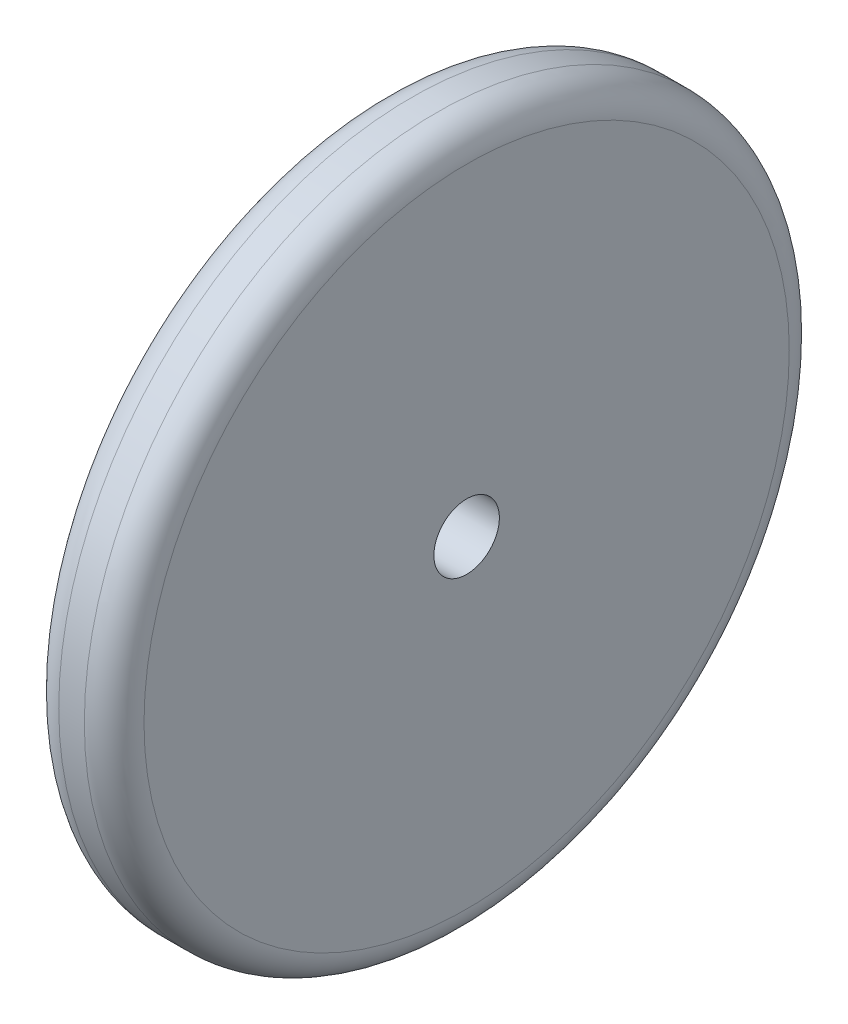
ISO-10303-21;
HEADER;
FILE_DESCRIPTION(('STEP AP214'),'2;1');
FILE_NAME('part.step','',(''),(''),'','','');
FILE_SCHEMA(('AUTOMOTIVE_DESIGN { 1 0 10303 214 1 1 1 1 }'));
ENDSEC;
DATA;
#1=APPLICATION_CONTEXT('core data for automotive mechanical design processes');
#2=APPLICATION_PROTOCOL_DEFINITION('international standard','automotive_design',2000,#1);
#3=PRODUCT_CONTEXT('',#1,'mechanical');
#4=PRODUCT('Part','Part','',(#3));
#5=PRODUCT_RELATED_PRODUCT_CATEGORY('part','',(#4));
#6=PRODUCT_DEFINITION_FORMATION('','',#4);
#7=PRODUCT_DEFINITION_CONTEXT('part definition',#1,'design');
#8=PRODUCT_DEFINITION('design','',#6,#7);
#9=PRODUCT_DEFINITION_SHAPE('','',#8);
#10=(LENGTH_UNIT() NAMED_UNIT(*) SI_UNIT(.MILLI.,.METRE.));
#11=(NAMED_UNIT(*) PLANE_ANGLE_UNIT() SI_UNIT($,.RADIAN.));
#12=(NAMED_UNIT(*) SI_UNIT($,.STERADIAN.) SOLID_ANGLE_UNIT());
#13=UNCERTAINTY_MEASURE_WITH_UNIT(LENGTH_MEASURE(1.E-05),#10,'distance_accuracy_value','');
#14=(GEOMETRIC_REPRESENTATION_CONTEXT(3) GLOBAL_UNCERTAINTY_ASSIGNED_CONTEXT((#13)) GLOBAL_UNIT_ASSIGNED_CONTEXT((#10,
#11,#12)) REPRESENTATION_CONTEXT('',''));
#15=CARTESIAN_POINT('',(0.,0.,0.));
#16=DIRECTION('',(0.,0.,1.));
#17=DIRECTION('',(1.,0.,0.));
#18=AXIS2_PLACEMENT_3D('',#15,#16,#17);
#19=CARTESIAN_POINT('',(-88.154662924112,-99.4140414395688,18.1527790152953));
#20=DIRECTION('',(-1.,0.,0.));
#21=DIRECTION('',(0.,0.,1.));
#22=AXIS2_PLACEMENT_3D('',#19,#20,#21);
#23=CYLINDRICAL_SURFACE('',#22,1.94999999999999);
#24=CARTESIAN_POINT('',(-78.634049076141,-99.4140414395688,18.1527790152953));
#25=DIRECTION('',(-1.,0.,0.));
#26=DIRECTION('',(0.,0.,1.));
#27=AXIS2_PLACEMENT_3D('',#24,#25,#26);
#28=CIRCLE('',#27,1.94999999999999);
#29=CARTESIAN_POINT('',(-78.634049076141,-99.4140414395688,20.1027790152953));
#30=VERTEX_POINT('',#29);
#31=EDGE_CURVE('E52',#30,#30,#28,.T.);
#32=ORIENTED_EDGE('',*,*,#31,.T.);
#33=EDGE_LOOP('',(#32));
#34=FACE_BOUND('',#33,.T.);
#35=CARTESIAN_POINT('',(-73.554049076141,-99.4140414395688,18.1527790152953));
#36=DIRECTION('',(-1.,0.,0.));
#37=DIRECTION('',(0.,0.,1.));
#38=AXIS2_PLACEMENT_3D('',#35,#36,#37);
#39=CIRCLE('',#38,1.94999999999999);
#40=CARTESIAN_POINT('',(-73.554049076141,-99.4140414395688,20.1027790152953));
#41=VERTEX_POINT('',#40);
#42=EDGE_CURVE('E55',#41,#41,#39,.T.);
#43=ORIENTED_EDGE('',*,*,#42,.F.);
#44=EDGE_LOOP('',(#43));
#45=FACE_BOUND('',#44,.T.);
#46=ADVANCED_FACE('F32',(#34,#45),#23,.F.);
#47=CARTESIAN_POINT('',(-78.634049076141,-97.4640414395688,18.1527790152953));
#48=DIRECTION('',(-1.,0.,0.));
#49=DIRECTION('',(0.,0.,1.));
#50=AXIS2_PLACEMENT_3D('',#47,#48,#49);
#51=PLANE('',#50);
#52=CARTESIAN_POINT('',(-78.634049076141,-99.4140414395688,18.1527790152953));
#53=DIRECTION('',(-1.,0.,0.));
#54=DIRECTION('',(0.,0.,1.));
#55=AXIS2_PLACEMENT_3D('',#52,#53,#54);
#56=CIRCLE('',#55,19.222);
#57=CARTESIAN_POINT('',(-78.634049076141,-99.4140414395688,37.3747790152953));
#58=VERTEX_POINT('',#57);
#59=EDGE_CURVE('E47',#58,#58,#56,.T.);
#60=ORIENTED_EDGE('',*,*,#59,.T.);
#61=EDGE_LOOP('',(#60));
#62=FACE_BOUND('',#61,.T.);
#63=ORIENTED_EDGE('',*,*,#31,.F.);
#64=EDGE_LOOP('',(#63));
#65=FACE_BOUND('',#64,.T.);
#66=ADVANCED_FACE('F62',(#62,#65),#51,.T.);
#67=CARTESIAN_POINT('',(-88.154662924112,-99.4140414395688,18.1527790152953));
#68=DIRECTION('',(-1.,0.,0.));
#69=DIRECTION('',(0.,0.,1.));
#70=AXIS2_PLACEMENT_3D('',#67,#68,#69);
#71=CYLINDRICAL_SURFACE('',#70,21.);
#72=CARTESIAN_POINT('',(-76.856049076141,-99.4140414395688,18.1527790152953));
#73=DIRECTION('',(-1.,0.,0.));
#74=DIRECTION('',(0.,0.,1.));
#75=AXIS2_PLACEMENT_3D('',#72,#73,#74);
#76=CIRCLE('',#75,21.);
#77=CARTESIAN_POINT('',(-76.856049076141,-99.4140414395688,39.1527790152953));
#78=VERTEX_POINT('',#77);
#79=EDGE_CURVE('E39',#78,#78,#76,.F.);
#80=ORIENTED_EDGE('',*,*,#79,.T.);
#81=EDGE_LOOP('',(#80));
#82=FACE_BOUND('',#81,.T.);
#83=CARTESIAN_POINT('',(-75.332049076141,-99.4140414395688,18.1527790152953));
#84=DIRECTION('',(1.,0.,0.));
#85=DIRECTION('',(0.,0.,-1.));
#86=AXIS2_PLACEMENT_3D('',#83,#84,#85);
#87=CIRCLE('',#86,21.);
#88=CARTESIAN_POINT('',(-75.332049076141,-99.4140414395688,-2.84722098470466));
#89=VERTEX_POINT('',#88);
#90=EDGE_CURVE('E43',#89,#89,#87,.F.);
#91=ORIENTED_EDGE('',*,*,#90,.T.);
#92=EDGE_LOOP('',(#91));
#93=FACE_BOUND('',#92,.T.);
#94=ADVANCED_FACE('F68',(#82,#93),#71,.T.);
#95=CARTESIAN_POINT('',(-73.554049076141,-97.4640414395688,18.1527790152953));
#96=DIRECTION('',(1.,0.,0.));
#97=DIRECTION('',(0.,0.,-1.));
#98=AXIS2_PLACEMENT_3D('',#95,#96,#97);
#99=PLANE('',#98);
#100=CARTESIAN_POINT('',(-73.554049076141,-99.4140414395688,18.1527790152953));
#101=DIRECTION('',(1.,0.,0.));
#102=DIRECTION('',(0.,0.,-1.));
#103=AXIS2_PLACEMENT_3D('',#100,#101,#102);
#104=CIRCLE('',#103,19.222);
#105=CARTESIAN_POINT('',(-73.554049076141,-99.4140414395688,-1.06922098470466));
#106=VERTEX_POINT('',#105);
#107=EDGE_CURVE('E10',#106,#106,#104,.T.);
#108=ORIENTED_EDGE('',*,*,#107,.T.);
#109=EDGE_LOOP('',(#108));
#110=FACE_BOUND('',#109,.T.);
#111=ORIENTED_EDGE('',*,*,#42,.T.);
#112=EDGE_LOOP('',(#111));
#113=FACE_BOUND('',#112,.T.);
#114=ADVANCED_FACE('F59',(#110,#113),#99,.T.);
#115=CARTESIAN_POINT('',(-76.856049076141,-99.4140414395688,18.1527790152953));
#116=DIRECTION('',(-1.,0.,0.));
#117=DIRECTION('',(0.,0.,1.));
#118=AXIS2_PLACEMENT_3D('',#115,#116,#117);
#119=TOROIDAL_SURFACE('',#118,19.222,1.778);
#120=ORIENTED_EDGE('',*,*,#79,.F.);
#121=EDGE_LOOP('',(#120));
#122=FACE_BOUND('',#121,.T.);
#123=ORIENTED_EDGE('',*,*,#59,.F.);
#124=EDGE_LOOP('',(#123));
#125=FACE_BOUND('',#124,.T.);
#126=ADVANCED_FACE('F72',(#122,#125),#119,.T.);
#127=CARTESIAN_POINT('',(-75.332049076141,-99.4140414395688,18.1527790152953));
#128=DIRECTION('',(1.,0.,0.));
#129=DIRECTION('',(0.,0.,-1.));
#130=AXIS2_PLACEMENT_3D('',#127,#128,#129);
#131=TOROIDAL_SURFACE('',#130,19.222,1.778);
#132=ORIENTED_EDGE('',*,*,#107,.F.);
#133=EDGE_LOOP('',(#132));
#134=FACE_BOUND('',#133,.T.);
#135=ORIENTED_EDGE('',*,*,#90,.F.);
#136=EDGE_LOOP('',(#135));
#137=FACE_BOUND('',#136,.T.);
#138=ADVANCED_FACE('F34',(#134,#137),#131,.T.);
#139=CLOSED_SHELL('',(#46,#66,#94,#114,#126,#138));
#140=MANIFOLD_SOLID_BREP('B2',#139);
#141=ADVANCED_BREP_SHAPE_REPRESENTATION('',(#18,#140),#14);
#142=SHAPE_DEFINITION_REPRESENTATION(#9,#141);
ENDSEC;
END-ISO-10303-21;
